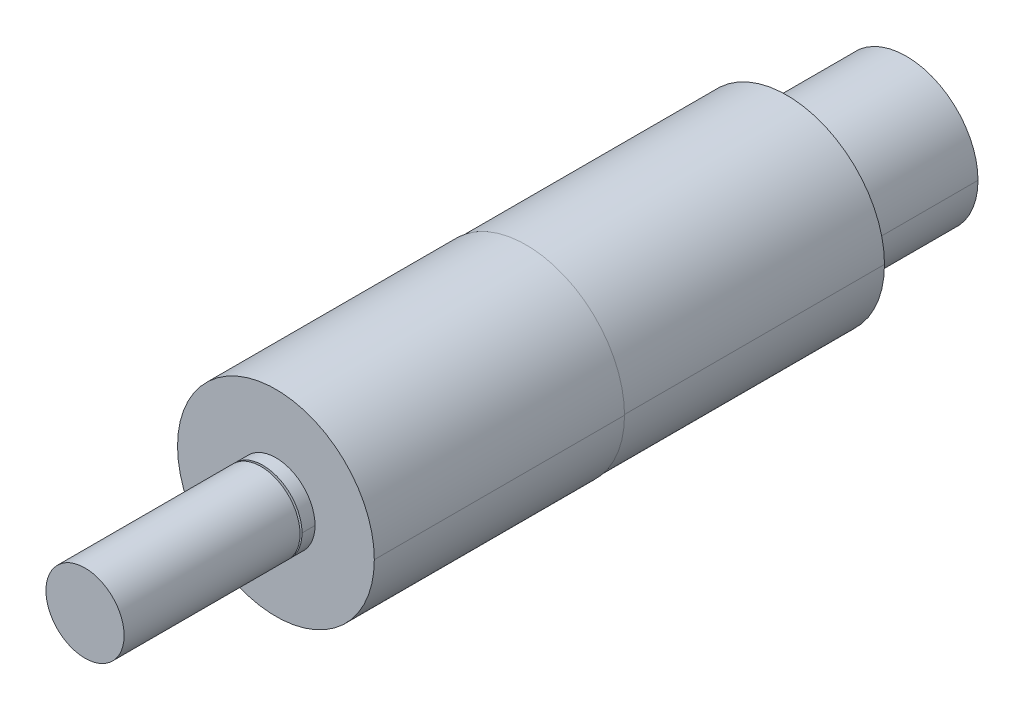
ISO-10303-21;
HEADER;
FILE_DESCRIPTION(('STEP AP214'),'2;1');
FILE_NAME('part.step','',(''),(''),'','','');
FILE_SCHEMA(('AUTOMOTIVE_DESIGN { 1 0 10303 214 1 1 1 1 }'));
ENDSEC;
DATA;
#1=APPLICATION_CONTEXT('core data for automotive mechanical design processes');
#2=APPLICATION_PROTOCOL_DEFINITION('international standard','automotive_design',2000,#1);
#3=PRODUCT_CONTEXT('',#1,'mechanical');
#4=PRODUCT('Part','Part','',(#3));
#5=PRODUCT_RELATED_PRODUCT_CATEGORY('part','',(#4));
#6=PRODUCT_DEFINITION_FORMATION('','',#4);
#7=PRODUCT_DEFINITION_CONTEXT('part definition',#1,'design');
#8=PRODUCT_DEFINITION('design','',#6,#7);
#9=PRODUCT_DEFINITION_SHAPE('','',#8);
#10=(LENGTH_UNIT() NAMED_UNIT(*) SI_UNIT(.MILLI.,.METRE.));
#11=(NAMED_UNIT(*) PLANE_ANGLE_UNIT() SI_UNIT($,.RADIAN.));
#12=(NAMED_UNIT(*) SI_UNIT($,.STERADIAN.) SOLID_ANGLE_UNIT());
#13=UNCERTAINTY_MEASURE_WITH_UNIT(LENGTH_MEASURE(1.E-05),#10,'distance_accuracy_value','');
#14=(GEOMETRIC_REPRESENTATION_CONTEXT(3) GLOBAL_UNCERTAINTY_ASSIGNED_CONTEXT((#13)) GLOBAL_UNIT_ASSIGNED_CONTEXT((#10,
#11,#12)) REPRESENTATION_CONTEXT('',''));
#15=CARTESIAN_POINT('',(0.,0.,0.));
#16=DIRECTION('',(0.,0.,1.));
#17=DIRECTION('',(1.,0.,0.));
#18=AXIS2_PLACEMENT_3D('',#15,#16,#17);
#19=CARTESIAN_POINT('',(0.,0.,40.7));
#20=DIRECTION('',(0.,0.,1.));
#21=DIRECTION('',(1.,0.,0.));
#22=AXIS2_PLACEMENT_3D('',#19,#20,#21);
#23=CYLINDRICAL_SURFACE('',#22,6.);
#24=CARTESIAN_POINT('',(0.,0.,40.7));
#25=DIRECTION('',(0.,0.,1.));
#26=DIRECTION('',(1.,0.,0.));
#27=AXIS2_PLACEMENT_3D('',#24,#25,#26);
#28=CIRCLE('',#27,6.);
#29=CARTESIAN_POINT('',(6.,0.,40.7));
#30=VERTEX_POINT('',#29);
#31=EDGE_CURVE('P0_E76',#30,#30,#28,.T.);
#32=ORIENTED_EDGE('',*,*,#31,.T.);
#33=EDGE_LOOP('',(#32));
#34=FACE_BOUND('',#33,.T.);
#35=CARTESIAN_POINT('',(0.,0.,67.7));
#36=DIRECTION('',(0.,0.,1.));
#37=DIRECTION('',(1.,0.,0.));
#38=AXIS2_PLACEMENT_3D('',#35,#36,#37);
#39=CIRCLE('',#38,6.);
#40=CARTESIAN_POINT('',(6.,0.,67.7));
#41=VERTEX_POINT('',#40);
#42=EDGE_CURVE('P0_E113',#41,#41,#39,.T.);
#43=ORIENTED_EDGE('',*,*,#42,.F.);
#44=EDGE_LOOP('',(#43));
#45=FACE_BOUND('',#44,.T.);
#46=ADVANCED_FACE('P0_F40',(#34,#45),#23,.T.);
#47=CARTESIAN_POINT('',(0.,0.,40.7));
#48=DIRECTION('',(0.,0.,1.));
#49=DIRECTION('',(1.,0.,0.));
#50=AXIS2_PLACEMENT_3D('',#47,#48,#49);
#51=PLANE('',#50);
#52=CARTESIAN_POINT('',(0.,0.,40.7));
#53=DIRECTION('',(0.,0.,1.));
#54=DIRECTION('',(1.,0.,0.));
#55=AXIS2_PLACEMENT_3D('',#52,#53,#54);
#56=CIRCLE('',#55,3.);
#57=CARTESIAN_POINT('',(3.,0.,40.7));
#58=VERTEX_POINT('',#57);
#59=CARTESIAN_POINT('',(-3.,0.,40.7));
#60=VERTEX_POINT('',#59);
#61=EDGE_CURVE('P0_E54',#58,#60,#56,.F.);
#62=ORIENTED_EDGE('',*,*,#61,.F.);
#63=CARTESIAN_POINT('',(0.,0.,40.7));
#64=DIRECTION('',(0.,0.,1.));
#65=DIRECTION('',(1.,0.,0.));
#66=AXIS2_PLACEMENT_3D('',#63,#64,#65);
#67=CIRCLE('',#66,3.);
#68=EDGE_CURVE('P0_E11',#60,#58,#67,.F.);
#69=ORIENTED_EDGE('',*,*,#68,.F.);
#70=EDGE_LOOP('',(#62,#69));
#71=FACE_BOUND('',#70,.T.);
#72=ORIENTED_EDGE('',*,*,#31,.F.);
#73=EDGE_LOOP('',(#72));
#74=FACE_BOUND('',#73,.T.);
#75=ADVANCED_FACE('P0_F70',(#71,#74),#51,.F.);
#76=CARTESIAN_POINT('',(0.,0.,67.7));
#77=DIRECTION('',(0.,0.,1.));
#78=DIRECTION('',(1.,0.,0.));
#79=AXIS2_PLACEMENT_3D('',#76,#77,#78);
#80=PLANE('',#79);
#81=ORIENTED_EDGE('',*,*,#42,.T.);
#82=EDGE_LOOP('',(#81));
#83=FACE_BOUND('',#82,.T.);
#84=ADVANCED_FACE('P0_F99',(#83),#80,.T.);
#85=CARTESIAN_POINT('',(0.,0.,57.7));
#86=DIRECTION('',(0.,0.,-1.));
#87=DIRECTION('',(-1.,0.,0.));
#88=AXIS2_PLACEMENT_3D('',#85,#86,#87);
#89=CYLINDRICAL_SURFACE('',#88,3.);
#90=DIRECTION('',(0.,0.,-1.));
#91=VECTOR('',#90,1.);
#92=CARTESIAN_POINT('',(3.,0.,57.7));
#93=LINE('',#92,#91);
#94=CARTESIAN_POINT('',(3.,0.,40.4));
#95=VERTEX_POINT('',#94);
#96=EDGE_CURVE('P0_E75',#58,#95,#93,.T.);
#97=ORIENTED_EDGE('',*,*,#96,.F.);
#98=ORIENTED_EDGE('',*,*,#61,.T.);
#99=DIRECTION('',(0.,0.,-1.));
#100=VECTOR('',#99,1.);
#101=CARTESIAN_POINT('',(-3.,0.,57.7));
#102=LINE('',#101,#100);
#103=CARTESIAN_POINT('',(-3.,0.,40.4));
#104=VERTEX_POINT('',#103);
#105=EDGE_CURVE('P0_E65',#60,#104,#102,.T.);
#106=ORIENTED_EDGE('',*,*,#105,.T.);
#107=CARTESIAN_POINT('',(0.,0.,40.4));
#108=DIRECTION('',(0.,0.,1.));
#109=DIRECTION('',(1.,0.,0.));
#110=AXIS2_PLACEMENT_3D('',#107,#108,#109);
#111=CIRCLE('',#110,3.);
#112=EDGE_CURVE('P0_E48',#104,#95,#111,.T.);
#113=ORIENTED_EDGE('',*,*,#112,.T.);
#114=EDGE_LOOP('',(#97,#98,#106,#113));
#115=FACE_BOUND('',#114,.T.);
#116=ADVANCED_FACE('P0_F74',(#115),#89,.T.);
#117=CARTESIAN_POINT('',(0.,0.,57.7));
#118=DIRECTION('',(0.,0.,-1.));
#119=DIRECTION('',(-1.,0.,0.));
#120=AXIS2_PLACEMENT_3D('',#117,#118,#119);
#121=CYLINDRICAL_SURFACE('',#120,3.);
#122=ORIENTED_EDGE('',*,*,#105,.F.);
#123=ORIENTED_EDGE('',*,*,#68,.T.);
#124=ORIENTED_EDGE('',*,*,#96,.T.);
#125=CARTESIAN_POINT('',(0.,0.,40.4));
#126=DIRECTION('',(0.,0.,1.));
#127=DIRECTION('',(1.,0.,0.));
#128=AXIS2_PLACEMENT_3D('',#125,#126,#127);
#129=CIRCLE('',#128,3.);
#130=EDGE_CURVE('P0_E81',#95,#104,#129,.T.);
#131=ORIENTED_EDGE('',*,*,#130,.T.);
#132=EDGE_LOOP('',(#122,#123,#124,#131));
#133=FACE_BOUND('',#132,.T.);
#134=ADVANCED_FACE('P0_F79',(#133),#121,.T.);
#135=CARTESIAN_POINT('',(0.,0.,40.4));
#136=DIRECTION('',(0.,0.,1.));
#137=DIRECTION('',(1.,0.,0.));
#138=AXIS2_PLACEMENT_3D('',#135,#136,#137);
#139=PLANE('',#138);
#140=ORIENTED_EDGE('',*,*,#112,.F.);
#141=ORIENTED_EDGE('',*,*,#130,.F.);
#142=EDGE_LOOP('',(#140,#141));
#143=FACE_BOUND('',#142,.T.);
#144=ADVANCED_FACE('P0_F42',(#143),#139,.F.);
#145=CLOSED_SHELL('',(#46,#75,#84,#116,#134,#144));
#146=MANIFOLD_SOLID_BREP('P0_B2',#145);
#147=CARTESIAN_POINT('',(0.,0.,40.4));
#148=DIRECTION('',(0.,0.,1.));
#149=DIRECTION('',(1.,0.,0.));
#150=AXIS2_PLACEMENT_3D('',#147,#148,#149);
#151=PLANE('',#150);
#152=CARTESIAN_POINT('',(0.,0.,40.4));
#153=DIRECTION('',(0.,0.,1.));
#154=DIRECTION('',(1.,0.,0.));
#155=AXIS2_PLACEMENT_3D('',#152,#153,#154);
#156=CIRCLE('',#155,6.);
#157=CARTESIAN_POINT('',(-6.,0.,40.4));
#158=VERTEX_POINT('',#157);
#159=CARTESIAN_POINT('',(6.,0.,40.4));
#160=VERTEX_POINT('',#159);
#161=EDGE_CURVE('P1_E11',#158,#160,#156,.T.);
#162=ORIENTED_EDGE('',*,*,#161,.T.);
#163=CARTESIAN_POINT('',(0.,0.,40.4));
#164=DIRECTION('',(0.,0.,1.));
#165=DIRECTION('',(1.,0.,0.));
#166=AXIS2_PLACEMENT_3D('',#163,#164,#165);
#167=CIRCLE('',#166,6.);
#168=EDGE_CURVE('P1_E105',#160,#158,#167,.T.);
#169=ORIENTED_EDGE('',*,*,#168,.T.);
#170=EDGE_LOOP('',(#162,#169));
#171=FACE_BOUND('',#170,.T.);
#172=ADVANCED_FACE('P1_F16',(#171),#151,.T.);
#173=CARTESIAN_POINT('',(0.,0.,40.4));
#174=DIRECTION('',(0.,0.,-1.));
#175=DIRECTION('',(-1.,0.,0.));
#176=AXIS2_PLACEMENT_3D('',#173,#174,#175);
#177=CYLINDRICAL_SURFACE('',#176,6.);
#178=DIRECTION('',(0.,0.,-1.));
#179=VECTOR('',#178,1.);
#180=CARTESIAN_POINT('',(6.,0.,40.4));
#181=LINE('',#180,#179);
#182=CARTESIAN_POINT('',(6.,0.,38.4));
#183=VERTEX_POINT('',#182);
#184=EDGE_CURVE('P1_E103',#160,#183,#181,.T.);
#185=ORIENTED_EDGE('',*,*,#184,.F.);
#186=ORIENTED_EDGE('',*,*,#161,.F.);
#187=DIRECTION('',(0.,0.,-1.));
#188=VECTOR('',#187,1.);
#189=CARTESIAN_POINT('',(-6.,0.,40.4));
#190=LINE('',#189,#188);
#191=CARTESIAN_POINT('',(-6.,0.,38.4));
#192=VERTEX_POINT('',#191);
#193=EDGE_CURVE('P1_E92',#158,#192,#190,.T.);
#194=ORIENTED_EDGE('',*,*,#193,.T.);
#195=CARTESIAN_POINT('',(0.,0.,38.4));
#196=DIRECTION('',(0.,0.,1.));
#197=DIRECTION('',(1.,0.,0.));
#198=AXIS2_PLACEMENT_3D('',#195,#196,#197);
#199=CIRCLE('',#198,6.);
#200=EDGE_CURVE('P1_E26',#192,#183,#199,.T.);
#201=ORIENTED_EDGE('',*,*,#200,.T.);
#202=EDGE_LOOP('',(#185,#186,#194,#201));
#203=FACE_BOUND('',#202,.T.);
#204=ADVANCED_FACE('P1_F121',(#203),#177,.T.);
#205=CARTESIAN_POINT('',(0.,0.,0.));
#206=DIRECTION('',(0.,0.,1.));
#207=DIRECTION('',(1.,0.,0.));
#208=AXIS2_PLACEMENT_3D('',#205,#206,#207);
#209=PLANE('',#208);
#210=CARTESIAN_POINT('',(0.,0.,0.));
#211=DIRECTION('',(0.,0.,1.));
#212=DIRECTION('',(1.,0.,0.));
#213=AXIS2_PLACEMENT_3D('',#210,#211,#212);
#214=CIRCLE('',#213,15.1);
#215=CARTESIAN_POINT('',(-15.1,0.,0.));
#216=VERTEX_POINT('',#215);
#217=CARTESIAN_POINT('',(15.1,0.,0.));
#218=VERTEX_POINT('',#217);
#219=EDGE_CURVE('P1_E39',#216,#218,#214,.T.);
#220=ORIENTED_EDGE('',*,*,#219,.F.);
#221=CARTESIAN_POINT('',(0.,0.,0.));
#222=DIRECTION('',(0.,0.,1.));
#223=DIRECTION('',(1.,0.,0.));
#224=AXIS2_PLACEMENT_3D('',#221,#222,#223);
#225=CIRCLE('',#224,15.1);
#226=EDGE_CURVE('P1_E89',#218,#216,#225,.T.);
#227=ORIENTED_EDGE('',*,*,#226,.F.);
#228=EDGE_LOOP('',(#220,#227));
#229=FACE_BOUND('',#228,.T.);
#230=ADVANCED_FACE('P1_F119',(#229),#209,.F.);
#231=CARTESIAN_POINT('',(0.,0.,38.4));
#232=DIRECTION('',(0.,0.,1.));
#233=DIRECTION('',(1.,0.,0.));
#234=AXIS2_PLACEMENT_3D('',#231,#232,#233);
#235=PLANE('',#234);
#236=ORIENTED_EDGE('',*,*,#200,.F.);
#237=CARTESIAN_POINT('',(0.,0.,38.4));
#238=DIRECTION('',(0.,0.,1.));
#239=DIRECTION('',(1.,0.,0.));
#240=AXIS2_PLACEMENT_3D('',#237,#238,#239);
#241=CIRCLE('',#240,6.);
#242=EDGE_CURVE('P1_E99',#183,#192,#241,.T.);
#243=ORIENTED_EDGE('',*,*,#242,.F.);
#244=EDGE_LOOP('',(#236,#243));
#245=FACE_BOUND('',#244,.T.);
#246=CARTESIAN_POINT('',(0.,0.,38.4));
#247=DIRECTION('',(0.,0.,1.));
#248=DIRECTION('',(1.,0.,0.));
#249=AXIS2_PLACEMENT_3D('',#246,#247,#248);
#250=CIRCLE('',#249,15.1);
#251=CARTESIAN_POINT('',(-15.1,0.,38.4));
#252=VERTEX_POINT('',#251);
#253=CARTESIAN_POINT('',(15.1,0.,38.4));
#254=VERTEX_POINT('',#253);
#255=EDGE_CURVE('P1_E77',#252,#254,#250,.T.);
#256=ORIENTED_EDGE('',*,*,#255,.T.);
#257=CARTESIAN_POINT('',(0.,0.,38.4));
#258=DIRECTION('',(0.,0.,1.));
#259=DIRECTION('',(1.,0.,0.));
#260=AXIS2_PLACEMENT_3D('',#257,#258,#259);
#261=CIRCLE('',#260,15.1);
#262=EDGE_CURVE('P1_E79',#254,#252,#261,.T.);
#263=ORIENTED_EDGE('',*,*,#262,.T.);
#264=EDGE_LOOP('',(#256,#263));
#265=FACE_BOUND('',#264,.T.);
#266=ADVANCED_FACE('P1_F18',(#245,#265),#235,.T.);
#267=CARTESIAN_POINT('',(0.,0.,38.4));
#268=DIRECTION('',(0.,0.,-1.));
#269=DIRECTION('',(-1.,0.,0.));
#270=AXIS2_PLACEMENT_3D('',#267,#268,#269);
#271=CYLINDRICAL_SURFACE('',#270,15.1);
#272=DIRECTION('',(0.,0.,-1.));
#273=VECTOR('',#272,1.);
#274=CARTESIAN_POINT('',(15.1,0.,38.4));
#275=LINE('',#274,#273);
#276=EDGE_CURVE('P1_E20',#254,#218,#275,.T.);
#277=ORIENTED_EDGE('',*,*,#276,.F.);
#278=ORIENTED_EDGE('',*,*,#255,.F.);
#279=DIRECTION('',(0.,0.,-1.));
#280=VECTOR('',#279,1.);
#281=CARTESIAN_POINT('',(-15.1,0.,38.4));
#282=LINE('',#281,#280);
#283=EDGE_CURVE('P1_E82',#252,#216,#282,.T.);
#284=ORIENTED_EDGE('',*,*,#283,.T.);
#285=ORIENTED_EDGE('',*,*,#219,.T.);
#286=EDGE_LOOP('',(#277,#278,#284,#285));
#287=FACE_BOUND('',#286,.T.);
#288=ADVANCED_FACE('P1_F85',(#287),#271,.T.);
#289=CARTESIAN_POINT('',(0.,0.,38.4));
#290=DIRECTION('',(0.,0.,-1.));
#291=DIRECTION('',(-1.,0.,0.));
#292=AXIS2_PLACEMENT_3D('',#289,#290,#291);
#293=CYLINDRICAL_SURFACE('',#292,15.1);
#294=ORIENTED_EDGE('',*,*,#262,.F.);
#295=ORIENTED_EDGE('',*,*,#276,.T.);
#296=ORIENTED_EDGE('',*,*,#226,.T.);
#297=ORIENTED_EDGE('',*,*,#283,.F.);
#298=EDGE_LOOP('',(#294,#295,#296,#297));
#299=FACE_BOUND('',#298,.T.);
#300=ADVANCED_FACE('P1_F90',(#299),#293,.T.);
#301=CARTESIAN_POINT('',(0.,0.,40.4));
#302=DIRECTION('',(0.,0.,-1.));
#303=DIRECTION('',(-1.,0.,0.));
#304=AXIS2_PLACEMENT_3D('',#301,#302,#303);
#305=CYLINDRICAL_SURFACE('',#304,6.);
#306=ORIENTED_EDGE('',*,*,#168,.F.);
#307=ORIENTED_EDGE('',*,*,#184,.T.);
#308=ORIENTED_EDGE('',*,*,#242,.T.);
#309=ORIENTED_EDGE('',*,*,#193,.F.);
#310=EDGE_LOOP('',(#306,#307,#308,#309));
#311=FACE_BOUND('',#310,.T.);
#312=ADVANCED_FACE('P1_F139',(#311),#305,.T.);
#313=CLOSED_SHELL('',(#172,#204,#230,#266,#288,#300,#312));
#314=MANIFOLD_SOLID_BREP('P1_B1',#313);
#315=CARTESIAN_POINT('',(0.,0.,40.4));
#316=DIRECTION('',(0.,0.,1.));
#317=DIRECTION('',(1.,0.,0.));
#318=AXIS2_PLACEMENT_3D('',#315,#316,#317);
#319=PLANE('',#318);
#320=CARTESIAN_POINT('',(0.,0.,40.4));
#321=DIRECTION('',(0.,0.,1.));
#322=DIRECTION('',(1.,0.,0.));
#323=AXIS2_PLACEMENT_3D('',#320,#321,#322);
#324=CIRCLE('',#323,3.);
#325=CARTESIAN_POINT('',(-3.,0.,40.4));
#326=VERTEX_POINT('',#325);
#327=CARTESIAN_POINT('',(3.,0.,40.4));
#328=VERTEX_POINT('',#327);
#329=EDGE_CURVE('P2_E11',#326,#328,#324,.T.);
#330=ORIENTED_EDGE('',*,*,#329,.F.);
#331=CARTESIAN_POINT('',(0.,0.,40.4));
#332=DIRECTION('',(0.,0.,1.));
#333=DIRECTION('',(1.,0.,0.));
#334=AXIS2_PLACEMENT_3D('',#331,#332,#333);
#335=CIRCLE('',#334,3.);
#336=EDGE_CURVE('P2_E66',#328,#326,#335,.T.);
#337=ORIENTED_EDGE('',*,*,#336,.F.);
#338=EDGE_LOOP('',(#330,#337));
#339=FACE_BOUND('',#338,.T.);
#340=ADVANCED_FACE('P2_F16',(#339),#319,.F.);
#341=CARTESIAN_POINT('',(0.,0.,57.7));
#342=DIRECTION('',(0.,0.,1.));
#343=DIRECTION('',(1.,0.,0.));
#344=AXIS2_PLACEMENT_3D('',#341,#342,#343);
#345=PLANE('',#344);
#346=CARTESIAN_POINT('',(0.,0.,57.7));
#347=DIRECTION('',(0.,0.,1.));
#348=DIRECTION('',(1.,0.,0.));
#349=AXIS2_PLACEMENT_3D('',#346,#347,#348);
#350=CIRCLE('',#349,3.);
#351=CARTESIAN_POINT('',(-3.,0.,57.7));
#352=VERTEX_POINT('',#351);
#353=CARTESIAN_POINT('',(3.,0.,57.7));
#354=VERTEX_POINT('',#353);
#355=EDGE_CURVE('P2_E26',#352,#354,#350,.T.);
#356=ORIENTED_EDGE('',*,*,#355,.T.);
#357=CARTESIAN_POINT('',(0.,0.,57.7));
#358=DIRECTION('',(0.,0.,1.));
#359=DIRECTION('',(1.,0.,0.));
#360=AXIS2_PLACEMENT_3D('',#357,#358,#359);
#361=CIRCLE('',#360,3.);
#362=EDGE_CURVE('P2_E58',#354,#352,#361,.T.);
#363=ORIENTED_EDGE('',*,*,#362,.T.);
#364=EDGE_LOOP('',(#356,#363));
#365=FACE_BOUND('',#364,.T.);
#366=ADVANCED_FACE('P2_F56',(#365),#345,.T.);
#367=CARTESIAN_POINT('',(0.,0.,57.7));
#368=DIRECTION('',(0.,0.,-1.));
#369=DIRECTION('',(-1.,0.,0.));
#370=AXIS2_PLACEMENT_3D('',#367,#368,#369);
#371=CYLINDRICAL_SURFACE('',#370,3.);
#372=DIRECTION('',(0.,0.,-1.));
#373=VECTOR('',#372,1.);
#374=CARTESIAN_POINT('',(3.,0.,57.7));
#375=LINE('',#374,#373);
#376=EDGE_CURVE('P2_E19',#354,#328,#375,.T.);
#377=ORIENTED_EDGE('',*,*,#376,.F.);
#378=ORIENTED_EDGE('',*,*,#355,.F.);
#379=DIRECTION('',(0.,0.,-1.));
#380=VECTOR('',#379,1.);
#381=CARTESIAN_POINT('',(-3.,0.,57.7));
#382=LINE('',#381,#380);
#383=EDGE_CURVE('P2_E60',#352,#326,#382,.T.);
#384=ORIENTED_EDGE('',*,*,#383,.T.);
#385=ORIENTED_EDGE('',*,*,#329,.T.);
#386=EDGE_LOOP('',(#377,#378,#384,#385));
#387=FACE_BOUND('',#386,.T.);
#388=ADVANCED_FACE('P2_F62',(#387),#371,.T.);
#389=CARTESIAN_POINT('',(0.,0.,57.7));
#390=DIRECTION('',(0.,0.,-1.));
#391=DIRECTION('',(-1.,0.,0.));
#392=AXIS2_PLACEMENT_3D('',#389,#390,#391);
#393=CYLINDRICAL_SURFACE('',#392,3.);
#394=ORIENTED_EDGE('',*,*,#362,.F.);
#395=ORIENTED_EDGE('',*,*,#376,.T.);
#396=ORIENTED_EDGE('',*,*,#336,.T.);
#397=ORIENTED_EDGE('',*,*,#383,.F.);
#398=EDGE_LOOP('',(#394,#395,#396,#397));
#399=FACE_BOUND('',#398,.T.);
#400=ADVANCED_FACE('P2_F67',(#399),#393,.T.);
#401=CLOSED_SHELL('',(#340,#366,#388,#400));
#402=MANIFOLD_SOLID_BREP('P2_B1',#401);
#403=CARTESIAN_POINT('',(0.,0.,0.));
#404=DIRECTION('',(0.,0.,-1.));
#405=DIRECTION('',(0.,-1.,0.));
#406=AXIS2_PLACEMENT_3D('',#403,#404,#405);
#407=PLANE('',#406);
#408=CARTESIAN_POINT('',(0.,0.,0.));
#409=DIRECTION('',(0.,0.,-1.));
#410=DIRECTION('',(-1.,0.,0.));
#411=AXIS2_PLACEMENT_3D('',#408,#409,#410);
#412=CIRCLE('',#411,15.);
#413=CARTESIAN_POINT('',(15.,0.,0.));
#414=VERTEX_POINT('',#413);
#415=CARTESIAN_POINT('',(-15.,0.,0.));
#416=VERTEX_POINT('',#415);
#417=EDGE_CURVE('P3_E11',#414,#416,#412,.T.);
#418=ORIENTED_EDGE('',*,*,#417,.F.);
#419=CARTESIAN_POINT('',(0.,0.,0.));
#420=DIRECTION('',(0.,0.,-1.));
#421=DIRECTION('',(-1.,0.,0.));
#422=AXIS2_PLACEMENT_3D('',#419,#420,#421);
#423=CIRCLE('',#422,15.);
#424=EDGE_CURVE('P3_E64',#416,#414,#423,.T.);
#425=ORIENTED_EDGE('',*,*,#424,.F.);
#426=EDGE_LOOP('',(#418,#425));
#427=FACE_BOUND('',#426,.T.);
#428=ADVANCED_FACE('P3_F16',(#427),#407,.F.);
#429=CARTESIAN_POINT('',(0.,0.,-40.));
#430=DIRECTION('',(0.,0.,-1.));
#431=DIRECTION('',(0.,-1.,0.));
#432=AXIS2_PLACEMENT_3D('',#429,#430,#431);
#433=PLANE('',#432);
#434=CARTESIAN_POINT('',(0.,0.,-40.));
#435=DIRECTION('',(0.,0.,-1.));
#436=DIRECTION('',(-1.,0.,0.));
#437=AXIS2_PLACEMENT_3D('',#434,#435,#436);
#438=CIRCLE('',#437,15.);
#439=CARTESIAN_POINT('',(15.,0.,-40.));
#440=VERTEX_POINT('',#439);
#441=CARTESIAN_POINT('',(-15.,0.,-40.));
#442=VERTEX_POINT('',#441);
#443=EDGE_CURVE('P3_E27',#440,#442,#438,.T.);
#444=ORIENTED_EDGE('',*,*,#443,.T.);
#445=CARTESIAN_POINT('',(0.,0.,-40.));
#446=DIRECTION('',(0.,0.,-1.));
#447=DIRECTION('',(-1.,0.,0.));
#448=AXIS2_PLACEMENT_3D('',#445,#446,#447);
#449=CIRCLE('',#448,15.);
#450=EDGE_CURVE('P3_E20',#442,#440,#449,.T.);
#451=ORIENTED_EDGE('',*,*,#450,.T.);
#452=EDGE_LOOP('',(#444,#451));
#453=FACE_BOUND('',#452,.T.);
#454=ADVANCED_FACE('P3_F18',(#453),#433,.T.);
#455=CARTESIAN_POINT('',(0.,0.,-40.));
#456=DIRECTION('',(0.,0.,1.));
#457=DIRECTION('',(1.,0.,0.));
#458=AXIS2_PLACEMENT_3D('',#455,#456,#457);
#459=CYLINDRICAL_SURFACE('',#458,15.);
#460=DIRECTION('',(0.,0.,1.));
#461=VECTOR('',#460,1.);
#462=CARTESIAN_POINT('',(-15.,0.,-40.));
#463=LINE('',#462,#461);
#464=EDGE_CURVE('P3_E56',#442,#416,#463,.T.);
#465=ORIENTED_EDGE('',*,*,#464,.F.);
#466=ORIENTED_EDGE('',*,*,#443,.F.);
#467=DIRECTION('',(0.,0.,1.));
#468=VECTOR('',#467,1.);
#469=CARTESIAN_POINT('',(15.,0.,-40.));
#470=LINE('',#469,#468);
#471=EDGE_CURVE('P3_E53',#440,#414,#470,.T.);
#472=ORIENTED_EDGE('',*,*,#471,.T.);
#473=ORIENTED_EDGE('',*,*,#417,.T.);
#474=EDGE_LOOP('',(#465,#466,#472,#473));
#475=FACE_BOUND('',#474,.T.);
#476=ADVANCED_FACE('P3_F52',(#475),#459,.T.);
#477=CARTESIAN_POINT('',(0.,0.,-40.));
#478=DIRECTION('',(0.,0.,1.));
#479=DIRECTION('',(1.,0.,0.));
#480=AXIS2_PLACEMENT_3D('',#477,#478,#479);
#481=CYLINDRICAL_SURFACE('',#480,15.);
#482=ORIENTED_EDGE('',*,*,#450,.F.);
#483=ORIENTED_EDGE('',*,*,#464,.T.);
#484=ORIENTED_EDGE('',*,*,#424,.T.);
#485=ORIENTED_EDGE('',*,*,#471,.F.);
#486=EDGE_LOOP('',(#482,#483,#484,#485));
#487=FACE_BOUND('',#486,.T.);
#488=ADVANCED_FACE('P3_F63',(#487),#481,.T.);
#489=CLOSED_SHELL('',(#428,#454,#476,#488));
#490=MANIFOLD_SOLID_BREP('P3_B1',#489);
#491=CARTESIAN_POINT('',(0.,0.,-40.));
#492=DIRECTION('',(0.,0.,-1.));
#493=DIRECTION('',(0.,-1.,0.));
#494=AXIS2_PLACEMENT_3D('',#491,#492,#493);
#495=PLANE('',#494);
#496=CARTESIAN_POINT('',(0.,0.,-40.));
#497=DIRECTION('',(0.,0.,-1.));
#498=DIRECTION('',(-1.,0.,0.));
#499=AXIS2_PLACEMENT_3D('',#496,#497,#498);
#500=CIRCLE('',#499,11.);
#501=CARTESIAN_POINT('',(11.,0.,-40.));
#502=VERTEX_POINT('',#501);
#503=CARTESIAN_POINT('',(-11.,0.,-40.));
#504=VERTEX_POINT('',#503);
#505=EDGE_CURVE('P4_E11',#502,#504,#500,.T.);
#506=ORIENTED_EDGE('',*,*,#505,.F.);
#507=CARTESIAN_POINT('',(0.,0.,-40.));
#508=DIRECTION('',(0.,0.,-1.));
#509=DIRECTION('',(-1.,0.,0.));
#510=AXIS2_PLACEMENT_3D('',#507,#508,#509);
#511=CIRCLE('',#510,11.);
#512=EDGE_CURVE('P4_E65',#504,#502,#511,.T.);
#513=ORIENTED_EDGE('',*,*,#512,.F.);
#514=EDGE_LOOP('',(#506,#513));
#515=FACE_BOUND('',#514,.T.);
#516=ADVANCED_FACE('P4_F16',(#515),#495,.F.);
#517=CARTESIAN_POINT('',(0.,0.,-58.35));
#518=DIRECTION('',(0.,0.,-1.));
#519=DIRECTION('',(0.,-1.,0.));
#520=AXIS2_PLACEMENT_3D('',#517,#518,#519);
#521=PLANE('',#520);
#522=CARTESIAN_POINT('',(0.,0.,-58.35));
#523=DIRECTION('',(0.,0.,-1.));
#524=DIRECTION('',(-1.,0.,0.));
#525=AXIS2_PLACEMENT_3D('',#522,#523,#524);
#526=CIRCLE('',#525,11.);
#527=CARTESIAN_POINT('',(11.,0.,-58.35));
#528=VERTEX_POINT('',#527);
#529=CARTESIAN_POINT('',(-11.,0.,-58.35));
#530=VERTEX_POINT('',#529);
#531=EDGE_CURVE('P4_E25',#528,#530,#526,.T.);
#532=ORIENTED_EDGE('',*,*,#531,.T.);
#533=CARTESIAN_POINT('',(0.,0.,-58.35));
#534=DIRECTION('',(0.,0.,-1.));
#535=DIRECTION('',(-1.,0.,0.));
#536=AXIS2_PLACEMENT_3D('',#533,#534,#535);
#537=CIRCLE('',#536,11.);
#538=EDGE_CURVE('P4_E19',#530,#528,#537,.T.);
#539=ORIENTED_EDGE('',*,*,#538,.T.);
#540=EDGE_LOOP('',(#532,#539));
#541=FACE_BOUND('',#540,.T.);
#542=ADVANCED_FACE('P4_F53',(#541),#521,.T.);
#543=CARTESIAN_POINT('',(0.,0.,-58.35));
#544=DIRECTION('',(0.,0.,1.));
#545=DIRECTION('',(1.,0.,0.));
#546=AXIS2_PLACEMENT_3D('',#543,#544,#545);
#547=CYLINDRICAL_SURFACE('',#546,11.);
#548=DIRECTION('',(0.,0.,1.));
#549=VECTOR('',#548,1.);
#550=CARTESIAN_POINT('',(-11.,0.,-58.35));
#551=LINE('',#550,#549);
#552=EDGE_CURVE('P4_E60',#530,#504,#551,.T.);
#553=ORIENTED_EDGE('',*,*,#552,.F.);
#554=ORIENTED_EDGE('',*,*,#531,.F.);
#555=DIRECTION('',(0.,0.,1.));
#556=VECTOR('',#555,1.);
#557=CARTESIAN_POINT('',(11.,0.,-58.35));
#558=LINE('',#557,#556);
#559=EDGE_CURVE('P4_E57',#528,#502,#558,.T.);
#560=ORIENTED_EDGE('',*,*,#559,.T.);
#561=ORIENTED_EDGE('',*,*,#505,.T.);
#562=EDGE_LOOP('',(#553,#554,#560,#561));
#563=FACE_BOUND('',#562,.T.);
#564=ADVANCED_FACE('P4_F61',(#563),#547,.T.);
#565=CARTESIAN_POINT('',(0.,0.,-58.35));
#566=DIRECTION('',(0.,0.,1.));
#567=DIRECTION('',(1.,0.,0.));
#568=AXIS2_PLACEMENT_3D('',#565,#566,#567);
#569=CYLINDRICAL_SURFACE('',#568,11.);
#570=ORIENTED_EDGE('',*,*,#538,.F.);
#571=ORIENTED_EDGE('',*,*,#552,.T.);
#572=ORIENTED_EDGE('',*,*,#512,.T.);
#573=ORIENTED_EDGE('',*,*,#559,.F.);
#574=EDGE_LOOP('',(#570,#571,#572,#573));
#575=FACE_BOUND('',#574,.T.);
#576=ADVANCED_FACE('P4_F67',(#575),#569,.T.);
#577=CLOSED_SHELL('',(#516,#542,#564,#576));
#578=MANIFOLD_SOLID_BREP('P4_B1',#577);
#579=ADVANCED_BREP_SHAPE_REPRESENTATION('',(#18,#146,#314,#402,#490,#578),#14);
#580=SHAPE_DEFINITION_REPRESENTATION(#9,#579);
ENDSEC;
END-ISO-10303-21;
